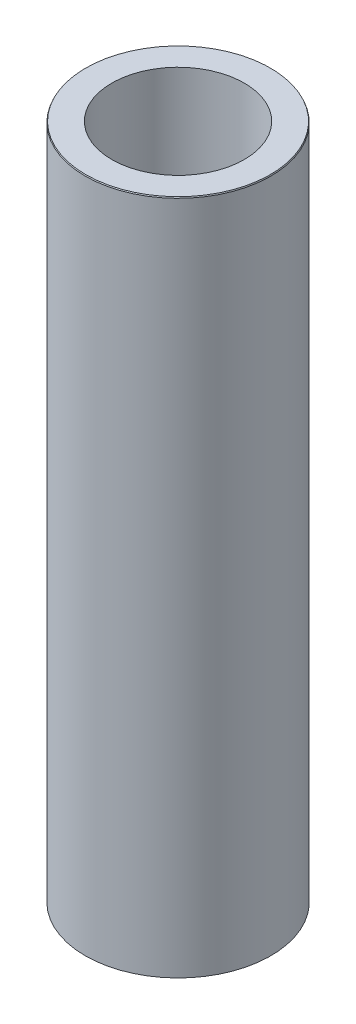
ISO-10303-21;
HEADER;
FILE_DESCRIPTION(('STEP AP214'),'2;1');
FILE_NAME('part.step','',(''),(''),'','','');
FILE_SCHEMA(('AUTOMOTIVE_DESIGN { 1 0 10303 214 1 1 1 1 }'));
ENDSEC;
DATA;
#1=APPLICATION_CONTEXT('core data for automotive mechanical design processes');
#2=APPLICATION_PROTOCOL_DEFINITION('international standard','automotive_design',2000,#1);
#3=PRODUCT_CONTEXT('',#1,'mechanical');
#4=PRODUCT('Part','Part','',(#3));
#5=PRODUCT_RELATED_PRODUCT_CATEGORY('part','',(#4));
#6=PRODUCT_DEFINITION_FORMATION('','',#4);
#7=PRODUCT_DEFINITION_CONTEXT('part definition',#1,'design');
#8=PRODUCT_DEFINITION('design','',#6,#7);
#9=PRODUCT_DEFINITION_SHAPE('','',#8);
#10=(LENGTH_UNIT() NAMED_UNIT(*) SI_UNIT(.MILLI.,.METRE.));
#11=(NAMED_UNIT(*) PLANE_ANGLE_UNIT() SI_UNIT($,.RADIAN.));
#12=(NAMED_UNIT(*) SI_UNIT($,.STERADIAN.) SOLID_ANGLE_UNIT());
#13=UNCERTAINTY_MEASURE_WITH_UNIT(LENGTH_MEASURE(1.E-05),#10,'distance_accuracy_value','');
#14=(GEOMETRIC_REPRESENTATION_CONTEXT(3) GLOBAL_UNCERTAINTY_ASSIGNED_CONTEXT((#13)) GLOBAL_UNIT_ASSIGNED_CONTEXT((#10,
#11,#12)) REPRESENTATION_CONTEXT('',''));
#15=CARTESIAN_POINT('',(0.,0.,0.));
#16=DIRECTION('',(0.,0.,1.));
#17=DIRECTION('',(1.,0.,0.));
#18=AXIS2_PLACEMENT_3D('',#15,#16,#17);
#19=CARTESIAN_POINT('',(0.,401.184286263356,0.));
#20=DIRECTION('',(0.,-1.,0.));
#21=DIRECTION('',(0.,0.,-1.));
#22=AXIS2_PLACEMENT_3D('',#19,#20,#21);
#23=CYLINDRICAL_SURFACE('',#22,55.);
#24=CARTESIAN_POINT('',(0.,400.531789236765,0.));
#25=DIRECTION('',(0.,1.,0.));
#26=DIRECTION('',(0.,0.,1.));
#27=AXIS2_PLACEMENT_3D('',#24,#25,#26);
#28=CIRCLE('',#27,55.);
#29=CARTESIAN_POINT('',(0.,400.531789236765,55.));
#30=VERTEX_POINT('',#29);
#31=EDGE_CURVE('E50',#30,#30,#28,.F.);
#32=ORIENTED_EDGE('',*,*,#31,.T.);
#33=EDGE_LOOP('',(#32));
#34=FACE_BOUND('',#33,.T.);
#35=CARTESIAN_POINT('',(0.,0.277147950957624,0.));
#36=DIRECTION('',(0.,1.,0.));
#37=DIRECTION('',(0.,0.,1.));
#38=AXIS2_PLACEMENT_3D('',#35,#36,#37);
#39=CIRCLE('',#38,55.);
#40=CARTESIAN_POINT('',(0.,0.277147950957624,55.));
#41=VERTEX_POINT('',#40);
#42=EDGE_CURVE('E51',#41,#41,#39,.T.);
#43=ORIENTED_EDGE('',*,*,#42,.T.);
#44=EDGE_LOOP('',(#43));
#45=FACE_BOUND('',#44,.T.);
#46=ADVANCED_FACE('F39',(#34,#45),#23,.T.);
#47=CARTESIAN_POINT('',(0.,401.184286263356,0.));
#48=DIRECTION('',(0.,1.,0.));
#49=DIRECTION('',(0.,0.,1.));
#50=AXIS2_PLACEMENT_3D('',#47,#48,#49);
#51=PLANE('',#50);
#52=CARTESIAN_POINT('',(0.,401.184286263356,0.));
#53=DIRECTION('',(0.,1.,0.));
#54=DIRECTION('',(0.,0.,1.));
#55=AXIS2_PLACEMENT_3D('',#52,#53,#54);
#56=CIRCLE('',#55,54.7228520490424);
#57=CARTESIAN_POINT('',(0.,401.184286263356,54.7228520490424));
#58=VERTEX_POINT('',#57);
#59=EDGE_CURVE('E54',#58,#58,#56,.T.);
#60=ORIENTED_EDGE('',*,*,#59,.T.);
#61=EDGE_LOOP('',(#60));
#62=FACE_BOUND('',#61,.T.);
#63=CARTESIAN_POINT('',(0.,401.184286263356,0.));
#64=DIRECTION('',(0.,1.,0.));
#65=DIRECTION('',(0.,0.,1.));
#66=AXIS2_PLACEMENT_3D('',#63,#64,#65);
#67=CIRCLE('',#66,39.2815312669907);
#68=CARTESIAN_POINT('',(0.,401.184286263356,39.2815312669907));
#69=VERTEX_POINT('',#68);
#70=EDGE_CURVE('E58',#69,#69,#67,.T.);
#71=ORIENTED_EDGE('',*,*,#70,.F.);
#72=EDGE_LOOP('',(#71));
#73=FACE_BOUND('',#72,.T.);
#74=ADVANCED_FACE('F69',(#62,#73),#51,.T.);
#75=CARTESIAN_POINT('',(0.,0.,0.));
#76=DIRECTION('',(0.,1.,0.));
#77=DIRECTION('',(0.,0.,1.));
#78=AXIS2_PLACEMENT_3D('',#75,#76,#77);
#79=PLANE('',#78);
#80=CARTESIAN_POINT('',(0.,0.,0.));
#81=DIRECTION('',(0.,1.,0.));
#82=DIRECTION('',(0.,0.,1.));
#83=AXIS2_PLACEMENT_3D('',#80,#81,#82);
#84=CIRCLE('',#83,54.3475029734087);
#85=CARTESIAN_POINT('',(0.,0.,54.3475029734087));
#86=VERTEX_POINT('',#85);
#87=EDGE_CURVE('E10',#86,#86,#84,.F.);
#88=ORIENTED_EDGE('',*,*,#87,.T.);
#89=EDGE_LOOP('',(#88));
#90=FACE_BOUND('',#89,.T.);
#91=CARTESIAN_POINT('',(0.,0.,0.));
#92=DIRECTION('',(0.,1.,0.));
#93=DIRECTION('',(0.,0.,1.));
#94=AXIS2_PLACEMENT_3D('',#91,#92,#93);
#95=CIRCLE('',#94,39.2815312669907);
#96=CARTESIAN_POINT('',(0.,0.,39.2815312669907));
#97=VERTEX_POINT('',#96);
#98=EDGE_CURVE('E63',#97,#97,#95,.T.);
#99=ORIENTED_EDGE('',*,*,#98,.T.);
#100=EDGE_LOOP('',(#99));
#101=FACE_BOUND('',#100,.T.);
#102=ADVANCED_FACE('F75',(#90,#101),#79,.F.);
#103=CARTESIAN_POINT('',(0.,401.184286263356,0.));
#104=DIRECTION('',(0.,-1.,0.));
#105=DIRECTION('',(0.,0.,-1.));
#106=AXIS2_PLACEMENT_3D('',#103,#104,#105);
#107=CYLINDRICAL_SURFACE('',#106,39.2815312669907);
#108=ORIENTED_EDGE('',*,*,#70,.T.);
#109=EDGE_LOOP('',(#108));
#110=FACE_BOUND('',#109,.T.);
#111=ORIENTED_EDGE('',*,*,#98,.F.);
#112=EDGE_LOOP('',(#111));
#113=FACE_BOUND('',#112,.T.);
#114=ADVANCED_FACE('F70',(#110,#113),#107,.F.);
#115=CARTESIAN_POINT('',(0.,401.184286263356,0.));
#116=DIRECTION('',(0.,-1.,0.));
#117=DIRECTION('',(0.,0.,-1.));
#118=AXIS2_PLACEMENT_3D('',#115,#116,#117);
#119=CONICAL_SURFACE('',#118,54.7228520490424,0.401658666990135);
#120=ORIENTED_EDGE('',*,*,#31,.F.);
#121=EDGE_LOOP('',(#120));
#122=FACE_BOUND('',#121,.T.);
#123=ORIENTED_EDGE('',*,*,#59,.F.);
#124=EDGE_LOOP('',(#123));
#125=FACE_BOUND('',#124,.T.);
#126=ADVANCED_FACE('F81',(#122,#125),#119,.T.);
#127=CARTESIAN_POINT('',(0.,0.277147950957624,0.));
#128=DIRECTION('',(0.,1.,0.));
#129=DIRECTION('',(0.,0.,1.));
#130=AXIS2_PLACEMENT_3D('',#127,#128,#129);
#131=CONICAL_SURFACE('',#130,55.,1.16913765980479);
#132=ORIENTED_EDGE('',*,*,#87,.F.);
#133=EDGE_LOOP('',(#132));
#134=FACE_BOUND('',#133,.T.);
#135=ORIENTED_EDGE('',*,*,#42,.F.);
#136=EDGE_LOOP('',(#135));
#137=FACE_BOUND('',#136,.T.);
#138=ADVANCED_FACE('F45',(#134,#137),#131,.T.);
#139=CLOSED_SHELL('',(#46,#74,#102,#114,#126,#138));
#140=MANIFOLD_SOLID_BREP('B2',#139);
#141=ADVANCED_BREP_SHAPE_REPRESENTATION('',(#18,#140),#14);
#142=SHAPE_DEFINITION_REPRESENTATION(#9,#141);
ENDSEC;
END-ISO-10303-21;
